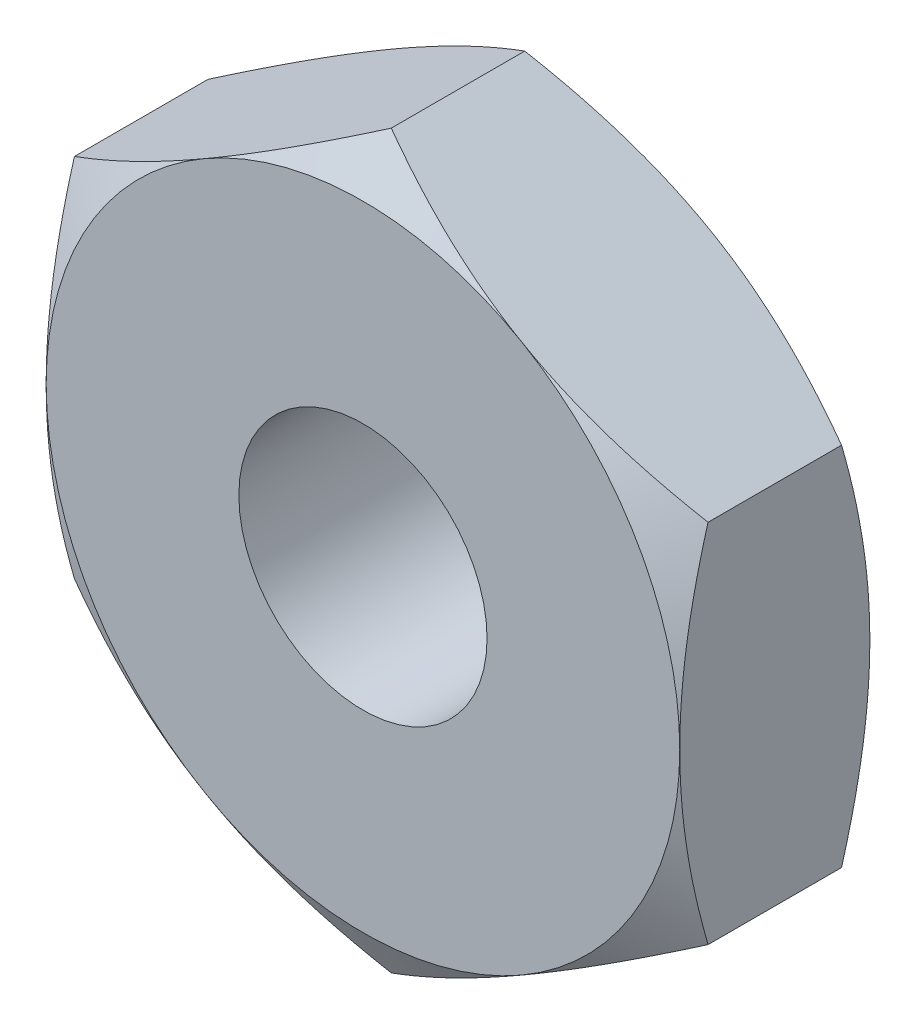
ISO-10303-21;
HEADER;
FILE_DESCRIPTION(('STEP AP214'),'2;1');
FILE_NAME('part.step','',(''),(''),'','','');
FILE_SCHEMA(('AUTOMOTIVE_DESIGN { 1 0 10303 214 1 1 1 1 }'));
ENDSEC;
DATA;
#1=APPLICATION_CONTEXT('core data for automotive mechanical design processes');
#2=APPLICATION_PROTOCOL_DEFINITION('international standard','automotive_design',2000,#1);
#3=PRODUCT_CONTEXT('',#1,'mechanical');
#4=PRODUCT('Part','Part','',(#3));
#5=PRODUCT_RELATED_PRODUCT_CATEGORY('part','',(#4));
#6=PRODUCT_DEFINITION_FORMATION('','',#4);
#7=PRODUCT_DEFINITION_CONTEXT('part definition',#1,'design');
#8=PRODUCT_DEFINITION('design','',#6,#7);
#9=PRODUCT_DEFINITION_SHAPE('','',#8);
#10=(LENGTH_UNIT() NAMED_UNIT(*) SI_UNIT(.MILLI.,.METRE.));
#11=(NAMED_UNIT(*) PLANE_ANGLE_UNIT() SI_UNIT($,.RADIAN.));
#12=(NAMED_UNIT(*) SI_UNIT($,.STERADIAN.) SOLID_ANGLE_UNIT());
#13=UNCERTAINTY_MEASURE_WITH_UNIT(LENGTH_MEASURE(1.E-05),#10,'distance_accuracy_value','');
#14=(GEOMETRIC_REPRESENTATION_CONTEXT(3) GLOBAL_UNCERTAINTY_ASSIGNED_CONTEXT((#13)) GLOBAL_UNIT_ASSIGNED_CONTEXT((#10,
#11,#12)) REPRESENTATION_CONTEXT('',''));
#15=CARTESIAN_POINT('',(0.,0.,0.));
#16=DIRECTION('',(0.,0.,1.));
#17=DIRECTION('',(1.,0.,0.));
#18=AXIS2_PLACEMENT_3D('',#15,#16,#17);
#19=CARTESIAN_POINT('',(2.,1.15470053837925,1.2));
#20=DIRECTION('',(-0.5,-0.866025403784439,0.));
#21=DIRECTION('',(0.866025403784439,-0.5,0.));
#22=AXIS2_PLACEMENT_3D('',#19,#20,#21);
#23=PLANE('',#22);
#24=CARTESIAN_POINT('',(2.0002,1.15458506832541,1.0213005333795));
#25=CARTESIAN_POINT('',(1.91230873709994,1.20532911262018,1.05061046389932));
#26=CARTESIAN_POINT('',(1.82365880552641,1.2565111744778,1.07726714801953));
#27=CARTESIAN_POINT('',(1.6448237530022,1.35976164019319,1.12379750897928));
#28=CARTESIAN_POINT('',(1.55463545349496,1.41183187919145,1.14365472361722));
#29=CARTESIAN_POINT('',(1.37537661423669,1.51532701829183,1.17456653597675));
#30=CARTESIAN_POINT('',(1.2863336617737,1.56673599086578,1.18582684840147));
#31=CARTESIAN_POINT('',(1.10782860221496,1.66979593505373,1.19927133740536));
#32=CARTESIAN_POINT('',(1.01836714429604,1.72144653186531,1.20146664504653));
#33=CARTESIAN_POINT('',(0.851191646451202,1.81796535054794,1.19690901066935));
#34=CARTESIAN_POINT('',(0.773452629734216,1.86284799277603,1.19127512531299));
#35=CARTESIAN_POINT('',(0.618481085463867,1.95232085557725,1.17341610473917));
#36=CARTESIAN_POINT('',(0.541249094258802,1.99691076648954,1.16118486397656));
#37=CARTESIAN_POINT('',(0.385957813517799,2.08656822922816,1.13060656313239));
#38=CARTESIAN_POINT('',(0.30791818689262,2.13162442866767,1.11212983293428));
#39=CARTESIAN_POINT('',(0.153003134307865,2.221064675979,1.07019448178714));
#40=CARTESIAN_POINT('',(0.07612572237688,2.26544987045196,1.04674571950769));
#41=CARTESIAN_POINT('',(-0.00019999999999991,2.30951654681234,1.0213005333795));
#42=B_SPLINE_CURVE_WITH_KNOTS('',3,(#24,#25,#26,#27,#28,#29,#30,#31,#32,#33,#34,#35,#36,#37,#38,
#39,#40,#41),.UNSPECIFIED.,.F.,.F.,(4,2,2,2,2,2,2,2,4),(0.,0.31703182469561,0.634825876346564,
0.944753967652636,1.25430138000371,1.52387047293094,1.79368946861028,2.06949491027634,
2.34475850821472),.UNSPECIFIED.);
#43=CARTESIAN_POINT('',(2.,1.15470053837925,1.02136720504592));
#44=VERTEX_POINT('',#43);
#45=CARTESIAN_POINT('',(0.999999999999999,1.73205080756888,1.2));
#46=VERTEX_POINT('',#45);
#47=EDGE_CURVE('E63',#44,#46,#42,.T.);
#48=ORIENTED_EDGE('',*,*,#47,.F.);
#49=DIRECTION('',(0.,0.,-1.));
#50=VECTOR('',#49,1.);
#51=CARTESIAN_POINT('',(2.,1.15470053837925,1.2));
#52=LINE('',#51,#50);
#53=CARTESIAN_POINT('',(2.,1.15470053837925,0.178632794954081));
#54=VERTEX_POINT('',#53);
#55=EDGE_CURVE('E302',#44,#54,#52,.T.);
#56=ORIENTED_EDGE('',*,*,#55,.T.);
#57=CARTESIAN_POINT('',(-0.0002,2.30951654681234,0.178699466620497));
#58=CARTESIAN_POINT('',(0.0876912629000598,2.25877250251758,0.149389536100678));
#59=CARTESIAN_POINT('',(0.176341194473591,2.20759044065995,0.122732851980466));
#60=CARTESIAN_POINT('',(0.355176246997802,2.10433997494456,0.0762024910207209));
#61=CARTESIAN_POINT('',(0.445364546505036,2.0522697359463,0.0563452763827792));
#62=CARTESIAN_POINT('',(0.624623385763306,1.94877459684592,0.0254334640232527));
#63=CARTESIAN_POINT('',(0.713666338226304,1.89736562427197,0.0141731515985313));
#64=CARTESIAN_POINT('',(0.892171397785043,1.79430568008402,0.000728662594642153));
#65=CARTESIAN_POINT('',(0.981632855703958,1.74265508327244,-0.00146664504653145));
#66=CARTESIAN_POINT('',(1.1488083535488,1.64613626458981,0.00309098933064917));
#67=CARTESIAN_POINT('',(1.22654737026578,1.60125362236173,0.00872487468701491));
#68=CARTESIAN_POINT('',(1.38151891453613,1.51178075956051,0.0265838952608286));
#69=CARTESIAN_POINT('',(1.4587509057412,1.46719084864821,0.0388151360234396));
#70=CARTESIAN_POINT('',(1.6140421864822,1.37753338590959,0.06939343686761));
#71=CARTESIAN_POINT('',(1.69208181310738,1.33247718647009,0.0878701670657161));
#72=CARTESIAN_POINT('',(1.84699686569214,1.24303693915875,0.129805518212856));
#73=CARTESIAN_POINT('',(1.92387427762312,1.1986517446858,0.153254280492314));
#74=CARTESIAN_POINT('',(2.0002,1.15458506832541,0.178699466620498));
#75=B_SPLINE_CURVE_WITH_KNOTS('',3,(#57,#58,#59,#60,#61,#62,#63,#64,#65,#66,#67,#68,#69,#70,#71,
#72,#73,#74),.UNSPECIFIED.,.F.,.F.,(4,2,2,2,2,2,2,2,4),(0.,0.317031824695609,0.634825876346563,
0.944753967652635,1.25430138000371,1.52387047293094,1.79368946861028,2.06949491027634,
2.34475850821472),.UNSPECIFIED.);
#76=CARTESIAN_POINT('',(1.,1.73205080756888,0.));
#77=VERTEX_POINT('',#76);
#78=EDGE_CURVE('E238',#77,#54,#75,.T.);
#79=ORIENTED_EDGE('',*,*,#78,.F.);
#80=CARTESIAN_POINT('',(0.,2.3094010767585,0.178632794954081));
#81=VERTEX_POINT('',#80);
#82=EDGE_CURVE('E256',#81,#77,#75,.T.);
#83=ORIENTED_EDGE('',*,*,#82,.F.);
#84=DIRECTION('',(0.,0.,-1.));
#85=VECTOR('',#84,1.);
#86=CARTESIAN_POINT('',(0.,2.3094010767585,1.2));
#87=LINE('',#86,#85);
#88=CARTESIAN_POINT('',(0.,2.3094010767585,1.02136720504592));
#89=VERTEX_POINT('',#88);
#90=EDGE_CURVE('E269',#89,#81,#87,.T.);
#91=ORIENTED_EDGE('',*,*,#90,.F.);
#92=EDGE_CURVE('E284',#46,#89,#42,.T.);
#93=ORIENTED_EDGE('',*,*,#92,.F.);
#94=EDGE_LOOP('',(#48,#56,#79,#83,#91,#93));
#95=FACE_BOUND('',#94,.T.);
#96=ADVANCED_FACE('F40',(#95),#23,.F.);
#97=CARTESIAN_POINT('',(0.,2.3094010767585,1.2));
#98=DIRECTION('',(0.5,-0.866025403784439,0.));
#99=DIRECTION('',(0.866025403784439,0.5,0.));
#100=AXIS2_PLACEMENT_3D('',#97,#98,#99);
#101=PLANE('',#100);
#102=CARTESIAN_POINT('',(0.000200000000000031,2.30951654681234,1.0213005333795));
#103=CARTESIAN_POINT('',(-0.0876912629000597,2.25877250251758,1.05061046389932));
#104=CARTESIAN_POINT('',(-0.176341194473591,2.20759044065995,1.07726714801953));
#105=CARTESIAN_POINT('',(-0.355176246997802,2.10433997494456,1.12379750897928));
#106=CARTESIAN_POINT('',(-0.445364546505036,2.0522697359463,1.14365472361722));
#107=CARTESIAN_POINT('',(-0.624623385763306,1.94877459684592,1.17456653597675));
#108=CARTESIAN_POINT('',(-0.713666338226304,1.89736562427197,1.18582684840147));
#109=CARTESIAN_POINT('',(-0.892171397785043,1.79430568008402,1.19927133740536));
#110=CARTESIAN_POINT('',(-0.981632855703958,1.74265508327244,1.20146664504653));
#111=CARTESIAN_POINT('',(-1.1488083535488,1.64613626458981,1.19690901066935));
#112=CARTESIAN_POINT('',(-1.22654737026578,1.60125362236173,1.19127512531299));
#113=CARTESIAN_POINT('',(-1.38151891453613,1.51178075956051,1.17341610473917));
#114=CARTESIAN_POINT('',(-1.4587509057412,1.46719084864821,1.16118486397656));
#115=CARTESIAN_POINT('',(-1.6140421864822,1.37753338590959,1.13060656313239));
#116=CARTESIAN_POINT('',(-1.69208181310738,1.33247718647009,1.11212983293428));
#117=CARTESIAN_POINT('',(-1.84699686569213,1.24303693915876,1.07019448178714));
#118=CARTESIAN_POINT('',(-1.92387427762312,1.1986517446858,1.04674571950769));
#119=CARTESIAN_POINT('',(-2.0002,1.15458506832541,1.0213005333795));
#120=B_SPLINE_CURVE_WITH_KNOTS('',3,(#102,#103,#104,#105,#106,#107,#108,#109,#110,#111,#112,
#113,#114,#115,#116,#117,#118,#119),.UNSPECIFIED.,.F.,.F.,(4,2,2,2,2,2,2,2,4),(0.,
0.31703182469561,0.634825876346563,0.944753967652635,1.25430138000371,1.52387047293094,
1.79368946861028,2.06949491027634,2.34475850821472),.UNSPECIFIED.);
#121=CARTESIAN_POINT('',(-0.999999999999999,1.73205080756888,1.2));
#122=VERTEX_POINT('',#121);
#123=EDGE_CURVE('E56',#89,#122,#120,.T.);
#124=ORIENTED_EDGE('',*,*,#123,.F.);
#125=ORIENTED_EDGE('',*,*,#90,.T.);
#126=CARTESIAN_POINT('',(-2.0002,1.15458506832541,0.178699466620498));
#127=CARTESIAN_POINT('',(-1.91230873709994,1.20532911262018,0.149389536100679));
#128=CARTESIAN_POINT('',(-1.82365880552641,1.2565111744778,0.122732851980467));
#129=CARTESIAN_POINT('',(-1.6448237530022,1.35976164019319,0.0762024910207211));
#130=CARTESIAN_POINT('',(-1.55463545349496,1.41183187919145,0.0563452763827794));
#131=CARTESIAN_POINT('',(-1.37537661423669,1.51532701829183,0.0254334640232528));
#132=CARTESIAN_POINT('',(-1.2863336617737,1.56673599086578,0.0141731515985312));
#133=CARTESIAN_POINT('',(-1.10782860221496,1.66979593505373,0.000728662594641993));
#134=CARTESIAN_POINT('',(-1.01836714429604,1.72144653186531,-0.0014666450465315));
#135=CARTESIAN_POINT('',(-0.851191646451201,1.81796535054794,0.00309098933064922));
#136=CARTESIAN_POINT('',(-0.773452629734216,1.86284799277603,0.00872487468701496));
#137=CARTESIAN_POINT('',(-0.618481085463866,1.95232085557725,0.0265838952608286));
#138=CARTESIAN_POINT('',(-0.541249094258801,1.99691076648954,0.0388151360234395));
#139=CARTESIAN_POINT('',(-0.385957813517799,2.08656822922816,0.0693934368676098));
#140=CARTESIAN_POINT('',(-0.30791818689262,2.13162442866767,0.0878701670657158));
#141=CARTESIAN_POINT('',(-0.153003134307865,2.221064675979,0.129805518212856));
#142=CARTESIAN_POINT('',(-0.0761257223768798,2.26544987045196,0.153254280492313));
#143=CARTESIAN_POINT('',(0.000199999999999939,2.30951654681234,0.178699466620497));
#144=B_SPLINE_CURVE_WITH_KNOTS('',3,(#126,#127,#128,#129,#130,#131,#132,#133,#134,#135,#136,
#137,#138,#139,#140,#141,#142,#143),.UNSPECIFIED.,.F.,.F.,(4,2,2,2,2,2,2,2,4),(0.,
0.31703182469561,0.634825876346564,0.944753967652636,1.25430138000371,1.52387047293094,
1.79368946861028,2.06949491027634,2.34475850821472),.UNSPECIFIED.);
#145=CARTESIAN_POINT('',(-0.999999999999999,1.73205080756888,0.));
#146=VERTEX_POINT('',#145);
#147=EDGE_CURVE('E200',#146,#81,#144,.T.);
#148=ORIENTED_EDGE('',*,*,#147,.F.);
#149=CARTESIAN_POINT('',(-2.,1.15470053837925,0.178632794954081));
#150=VERTEX_POINT('',#149);
#151=EDGE_CURVE('E255',#150,#146,#144,.T.);
#152=ORIENTED_EDGE('',*,*,#151,.F.);
#153=DIRECTION('',(0.,0.,-1.));
#154=VECTOR('',#153,1.);
#155=CARTESIAN_POINT('',(-2.,1.15470053837925,1.2));
#156=LINE('',#155,#154);
#157=CARTESIAN_POINT('',(-2.,1.15470053837925,1.02136720504592));
#158=VERTEX_POINT('',#157);
#159=EDGE_CURVE('E293',#158,#150,#156,.T.);
#160=ORIENTED_EDGE('',*,*,#159,.F.);
#161=EDGE_CURVE('E135',#122,#158,#120,.T.);
#162=ORIENTED_EDGE('',*,*,#161,.F.);
#163=EDGE_LOOP('',(#124,#125,#148,#152,#160,#162));
#164=FACE_BOUND('',#163,.T.);
#165=ADVANCED_FACE('F184',(#164),#101,.F.);
#166=CARTESIAN_POINT('',(-2.,1.15470053837925,1.2));
#167=DIRECTION('',(1.,0.,0.));
#168=DIRECTION('',(0.,0.,-1.));
#169=AXIS2_PLACEMENT_3D('',#166,#167,#168);
#170=PLANE('',#169);
#171=CARTESIAN_POINT('',(-2.,-3.12126753575195,0.214427111163392));
#172=CARTESIAN_POINT('',(-2.,-3.03373603218229,0.256966180284596));
#173=CARTESIAN_POINT('',(-2.,-2.94600566230316,0.29910295381188));
#174=CARTESIAN_POINT('',(-2.,-2.77004148520157,0.382345997342441));
#175=CARTESIAN_POINT('',(-2.,-2.68180760297106,0.42345210861389));
#176=CARTESIAN_POINT('',(-2.,-2.50428557268674,0.504610473872483));
#177=CARTESIAN_POINT('',(-2.,-2.41499431198977,0.544655942576512));
#178=CARTESIAN_POINT('',(-2.,-2.23570828617338,0.623133699796779));
#179=CARTESIAN_POINT('',(-2.,-2.14571355398512,0.661566063296118));
#180=CARTESIAN_POINT('',(-2.,-1.96191371862823,0.73761863742332));
#181=CARTESIAN_POINT('',(-2.,-1.86808038113767,0.775170980469068));
#182=CARTESIAN_POINT('',(-2.,-1.67934204004246,0.847473123124449));
#183=CARTESIAN_POINT('',(-2.,-1.58443713302449,0.882223173057815));
#184=CARTESIAN_POINT('',(-2.,-1.39354791487329,0.948034806351269));
#185=CARTESIAN_POINT('',(-2.,-1.29756601981645,0.979103328102883));
#186=CARTESIAN_POINT('',(-2.,-1.10422565942415,1.0365640778683));
#187=CARTESIAN_POINT('',(-2.,-1.00686763159879,1.06295775757173));
#188=CARTESIAN_POINT('',(-2.,-0.811250894561443,1.10967670182675));
#189=CARTESIAN_POINT('',(-2.,-0.713000178823259,1.13003482090968));
#190=CARTESIAN_POINT('',(-2.,-0.515257619984672,1.16354222714269));
#191=CARTESIAN_POINT('',(-2.,-0.415765905334768,1.17669225414199));
#192=CARTESIAN_POINT('',(-2.,-0.217342465065373,1.19455969688598));
#193=CARTESIAN_POINT('',(-2.,-0.118420933028611,1.19938710413721));
#194=CARTESIAN_POINT('',(-2.,0.0794683359848029,1.20050339645606));
#195=CARTESIAN_POINT('',(-2.,0.178436073915409,1.19679209666559));
#196=CARTESIAN_POINT('',(-2.,0.414659658698201,1.17806377856661));
#197=CARTESIAN_POINT('',(-2.,0.551609910334314,1.15916258692811));
#198=CARTESIAN_POINT('',(-2.,0.823054673746854,1.10826507507863));
#199=CARTESIAN_POINT('',(-2.,0.957546758578899,1.07625647399084));
#200=CARTESIAN_POINT('',(-2.,1.22689179605915,1.00181012644202));
#201=CARTESIAN_POINT('',(-2.,1.36168130453104,0.959148525574626));
#202=CARTESIAN_POINT('',(-2.,1.56197975779171,0.889897576844062));
#203=CARTESIAN_POINT('',(-2.,1.62842575478941,0.865939878069734));
#204=CARTESIAN_POINT('',(-2.,1.760766599361,0.816547213936001));
#205=CARTESIAN_POINT('',(-2.,1.82666145753252,0.791112277056875));
#206=CARTESIAN_POINT('',(-2.,1.99778681148072,0.723211373697483));
#207=CARTESIAN_POINT('',(-2.,2.10263074070295,0.679773738534194));
#208=CARTESIAN_POINT('',(-2.,2.31129679969803,0.590501658005109));
#209=CARTESIAN_POINT('',(-2.,2.41511883641139,0.544666996708215));
#210=CARTESIAN_POINT('',(-2.,2.62196120344372,0.451147524028329));
#211=CARTESIAN_POINT('',(-2.,2.72498128297199,0.403462159753722));
#212=CARTESIAN_POINT('',(-2.,2.93034706159689,0.306658203112772));
#213=CARTESIAN_POINT('',(-2.,3.03269274221776,0.257539571679235));
#214=CARTESIAN_POINT('',(-2.,3.33919760090587,0.108365604892724));
#215=CARTESIAN_POINT('',(-2.,3.54253566471784,0.00662505621000438));
#216=CARTESIAN_POINT('',(-2.,3.94769403711836,-0.199724734422693));
#217=CARTESIAN_POINT('',(-2.,4.14951461105219,-0.304333459250277));
#218=CARTESIAN_POINT('',(-2.,4.53210257052994,-0.505033547298434));
#219=CARTESIAN_POINT('',(-2.,4.71296829534757,-0.600937779133665));
#220=CARTESIAN_POINT('',(-2.,5.07407845287707,-0.793929706693538));
#221=CARTESIAN_POINT('',(-2.,5.25432285229911,-0.891017464603623));
#222=CARTESIAN_POINT('',(-2.,5.61378039587587,-1.08577789249214));
#223=CARTESIAN_POINT('',(-2.,5.79299500754525,-1.1834478572296));
#224=CARTESIAN_POINT('',(-2.,6.15103475769341,-1.37946951842422));
#225=CARTESIAN_POINT('',(-2.,6.32985992271886,-1.47782116637289));
#226=CARTESIAN_POINT('',(-2.,6.50854651271054,-1.57642218963439));
#227=B_SPLINE_CURVE_WITH_KNOTS('',3,(#171,#172,#173,#174,#175,#176,#177,#178,#179,#180,#181,
#182,#183,#184,#185,#186,#187,#188,#189,#190,#191,#192,#193,#194,#195,#196,#197,#198,#199,#200,
#201,#202,#203,#204,#205,#206,#207,#208,#209,#210,#211,#212,#213,#214,#215,#216,#217,#218,#219,
#220,#221,#222,#223,#224,#225,#226),.UNSPECIFIED.,.F.,.F.,(4,2,2,2,2,2,2,2,2,2,2,2,2,2,2,2,2,2,
2,2,2,2,2,2,2,2,2,4),(0.,0.291965851036328,0.583976394788328,0.877543441708637,1.17109682739876,
1.47426835870626,1.7774127781854,2.07997647024836,2.38244604114238,2.68323754387286,
2.98399816713488,3.28075257576361,3.57751340901528,3.99140512443003,4.40568552272406,
4.82953678217955,5.04142455234633,5.25330823879711,5.59372400123579,5.93417048231838,
6.27471946564408,6.61527774015,7.29734808498086,7.97929625318922,8.5934484852712,
9.20763312675056,9.81993507306976,10.4321938864851),.UNSPECIFIED.);
#228=CARTESIAN_POINT('',(-2.,0.,1.2));
#229=VERTEX_POINT('',#228);
#230=EDGE_CURVE('E129',#158,#229,#227,.F.);
#231=ORIENTED_EDGE('',*,*,#230,.F.);
#232=ORIENTED_EDGE('',*,*,#159,.T.);
#233=CARTESIAN_POINT('',(-2.,-3.12126753575195,0.985572888836608));
#234=CARTESIAN_POINT('',(-2.,-3.03373603218229,0.943033819715404));
#235=CARTESIAN_POINT('',(-2.,-2.94600566230316,0.90089704618812));
#236=CARTESIAN_POINT('',(-2.,-2.77004148520157,0.817654002657559));
#237=CARTESIAN_POINT('',(-2.,-2.68180760297106,0.77654789138611));
#238=CARTESIAN_POINT('',(-2.,-2.50428557268674,0.695389526127517));
#239=CARTESIAN_POINT('',(-2.,-2.41499431198977,0.655344057423488));
#240=CARTESIAN_POINT('',(-2.,-2.23570828617338,0.576866300203221));
#241=CARTESIAN_POINT('',(-2.,-2.14571355398512,0.538433936703882));
#242=CARTESIAN_POINT('',(-2.,-1.96191371862823,0.462381362576679));
#243=CARTESIAN_POINT('',(-2.,-1.86808038113767,0.424829019530932));
#244=CARTESIAN_POINT('',(-2.,-1.67934204004246,0.352526876875551));
#245=CARTESIAN_POINT('',(-2.,-1.58443713302449,0.317776826942185));
#246=CARTESIAN_POINT('',(-2.,-1.39354791487329,0.251965193648731));
#247=CARTESIAN_POINT('',(-2.,-1.29756601981645,0.220896671897117));
#248=CARTESIAN_POINT('',(-2.,-1.10422565942415,0.1634359221317));
#249=CARTESIAN_POINT('',(-2.,-1.00686763159879,0.137042242428268));
#250=CARTESIAN_POINT('',(-2.,-0.811250894561443,0.0903232981732528));
#251=CARTESIAN_POINT('',(-2.,-0.713000178823259,0.0699651790903172));
#252=CARTESIAN_POINT('',(-2.,-0.515257619984672,0.0364577728573079));
#253=CARTESIAN_POINT('',(-2.,-0.415765905334768,0.0233077458580066));
#254=CARTESIAN_POINT('',(-2.,-0.217342465065373,0.00544030311401896));
#255=CARTESIAN_POINT('',(-2.,-0.118420933028611,0.000612895862794048));
#256=CARTESIAN_POINT('',(-2.,0.0794683359848027,-0.000503396456061197));
#257=CARTESIAN_POINT('',(-2.,0.178436073915409,0.00320790333441122));
#258=CARTESIAN_POINT('',(-2.,0.414659658698201,0.0219362214333927));
#259=CARTESIAN_POINT('',(-2.,0.551609910334314,0.0408374130718859));
#260=CARTESIAN_POINT('',(-2.,0.823054673746854,0.0917349249213691));
#261=CARTESIAN_POINT('',(-2.,0.957546758578898,0.123743526009157));
#262=CARTESIAN_POINT('',(-2.,1.22689179605915,0.198189873557979));
#263=CARTESIAN_POINT('',(-2.,1.36168130453104,0.240851474425374));
#264=CARTESIAN_POINT('',(-2.,1.56197975779171,0.310102423155938));
#265=CARTESIAN_POINT('',(-2.,1.62842575478941,0.334060121930266));
#266=CARTESIAN_POINT('',(-2.,1.760766599361,0.383452786063999));
#267=CARTESIAN_POINT('',(-2.,1.82666145753252,0.408887722943125));
#268=CARTESIAN_POINT('',(-2.,1.99778681148072,0.476788626302517));
#269=CARTESIAN_POINT('',(-2.,2.10263074070295,0.520226261465806));
#270=CARTESIAN_POINT('',(-2.,2.31129679969803,0.609498341994891));
#271=CARTESIAN_POINT('',(-2.,2.41511883641139,0.655333003291785));
#272=CARTESIAN_POINT('',(-2.,2.62196120344372,0.748852475971671));
#273=CARTESIAN_POINT('',(-2.,2.72498128297198,0.796537840246278));
#274=CARTESIAN_POINT('',(-2.,2.93034706159689,0.893341796887228));
#275=CARTESIAN_POINT('',(-2.,3.03269274221776,0.942460428320764));
#276=CARTESIAN_POINT('',(-2.,3.33919760090587,1.09163439510727));
#277=CARTESIAN_POINT('',(-2.,3.54253566471784,1.19337494378999));
#278=CARTESIAN_POINT('',(-2.,3.94769403711836,1.39972473442269));
#279=CARTESIAN_POINT('',(-2.,4.14951461105219,1.50433345925028));
#280=CARTESIAN_POINT('',(-2.,4.53210257052994,1.70503354729843));
#281=CARTESIAN_POINT('',(-2.,4.71296829534757,1.80093777913366));
#282=CARTESIAN_POINT('',(-2.,5.07407845287707,1.99392970669354));
#283=CARTESIAN_POINT('',(-2.,5.2543228522991,2.09101746460362));
#284=CARTESIAN_POINT('',(-2.,5.61378039587587,2.28577789249214));
#285=CARTESIAN_POINT('',(-2.,5.79299500754525,2.3834478572296));
#286=CARTESIAN_POINT('',(-2.,6.15103475769341,2.57946951842421));
#287=CARTESIAN_POINT('',(-2.,6.32985992271886,2.67782116637289));
#288=CARTESIAN_POINT('',(-2.,6.50854651271054,2.77642218963439));
#289=B_SPLINE_CURVE_WITH_KNOTS('',3,(#233,#234,#235,#236,#237,#238,#239,#240,#241,#242,#243,
#244,#245,#246,#247,#248,#249,#250,#251,#252,#253,#254,#255,#256,#257,#258,#259,#260,#261,#262,
#263,#264,#265,#266,#267,#268,#269,#270,#271,#272,#273,#274,#275,#276,#277,#278,#279,#280,#281,
#282,#283,#284,#285,#286,#287,#288),.UNSPECIFIED.,.F.,.F.,(4,2,2,2,2,2,2,2,2,2,2,2,2,2,2,2,2,2,
2,2,2,2,2,2,2,2,2,4),(0.,0.291965851036328,0.583976394788328,0.877543441708637,1.17109682739876,
1.47426835870626,1.7774127781854,2.07997647024836,2.38244604114238,2.68323754387286,
2.98399816713488,3.28075257576361,3.57751340901528,3.99140512443003,4.40568552272406,
4.82953678217955,5.04142455234632,5.25330823879711,5.59372400123579,5.93417048231838,
6.27471946564408,6.61527774015,7.29734808498086,7.97929625318921,8.59344848527119,
9.20763312675055,9.81993507306976,10.4321938864851),.UNSPECIFIED.);
#290=CARTESIAN_POINT('',(-2.,0.,0.));
#291=VERTEX_POINT('',#290);
#292=EDGE_CURVE('E190',#291,#150,#289,.T.);
#293=ORIENTED_EDGE('',*,*,#292,.F.);
#294=CARTESIAN_POINT('',(-2.,-1.15470053837925,0.178632794954081));
#295=VERTEX_POINT('',#294);
#296=EDGE_CURVE('E198',#295,#291,#289,.T.);
#297=ORIENTED_EDGE('',*,*,#296,.F.);
#298=DIRECTION('',(0.,0.,-1.));
#299=VECTOR('',#298,1.);
#300=CARTESIAN_POINT('',(-2.,-1.15470053837925,1.2));
#301=LINE('',#300,#299);
#302=CARTESIAN_POINT('',(-2.,-1.15470053837925,1.02136720504592));
#303=VERTEX_POINT('',#302);
#304=EDGE_CURVE('E157',#303,#295,#301,.T.);
#305=ORIENTED_EDGE('',*,*,#304,.F.);
#306=EDGE_CURVE('E139',#229,#303,#227,.F.);
#307=ORIENTED_EDGE('',*,*,#306,.F.);
#308=EDGE_LOOP('',(#231,#232,#293,#297,#305,#307));
#309=FACE_BOUND('',#308,.T.);
#310=ADVANCED_FACE('F155',(#309),#170,.F.);
#311=CARTESIAN_POINT('',(-2.,-1.15470053837925,1.2));
#312=DIRECTION('',(0.5,0.866025403784439,0.));
#313=DIRECTION('',(-0.866025403784439,0.5,0.));
#314=AXIS2_PLACEMENT_3D('',#311,#312,#313);
#315=PLANE('',#314);
#316=CARTESIAN_POINT('',(-2.0002,-1.15458506832541,1.0213005333795));
#317=CARTESIAN_POINT('',(-1.91230873709994,-1.20532911262018,1.05061046389932));
#318=CARTESIAN_POINT('',(-1.82365880552641,-1.2565111744778,1.07726714801953));
#319=CARTESIAN_POINT('',(-1.6448237530022,-1.35976164019319,1.12379750897928));
#320=CARTESIAN_POINT('',(-1.55463545349496,-1.41183187919145,1.14365472361722));
#321=CARTESIAN_POINT('',(-1.37537661423669,-1.51532701829183,1.17456653597675));
#322=CARTESIAN_POINT('',(-1.2863336617737,-1.56673599086578,1.18582684840147));
#323=CARTESIAN_POINT('',(-1.10782860221496,-1.66979593505373,1.19927133740536));
#324=CARTESIAN_POINT('',(-1.01836714429604,-1.72144653186531,1.20146664504653));
#325=CARTESIAN_POINT('',(-0.851191646451202,-1.81796535054794,1.19690901066935));
#326=CARTESIAN_POINT('',(-0.773452629734216,-1.86284799277603,1.19127512531299));
#327=CARTESIAN_POINT('',(-0.618481085463867,-1.95232085557725,1.17341610473917));
#328=CARTESIAN_POINT('',(-0.541249094258802,-1.99691076648954,1.16118486397656));
#329=CARTESIAN_POINT('',(-0.385957813517799,-2.08656822922816,1.13060656313239));
#330=CARTESIAN_POINT('',(-0.307918186892621,-2.13162442866767,1.11212983293428));
#331=CARTESIAN_POINT('',(-0.153003134307866,-2.221064675979,1.07019448178714));
#332=CARTESIAN_POINT('',(-0.0761257223768802,-2.26544987045196,1.04674571950769));
#333=CARTESIAN_POINT('',(0.000199999999999905,-2.30951654681234,1.0213005333795));
#334=B_SPLINE_CURVE_WITH_KNOTS('',3,(#316,#317,#318,#319,#320,#321,#322,#323,#324,#325,#326,
#327,#328,#329,#330,#331,#332,#333),.UNSPECIFIED.,.F.,.F.,(4,2,2,2,2,2,2,2,4),(0.,
0.31703182469561,0.634825876346563,0.944753967652635,1.25430138000371,1.52387047293094,
1.79368946861028,2.06949491027634,2.34475850821472),.UNSPECIFIED.);
#335=CARTESIAN_POINT('',(-0.999999999999999,-1.73205080756888,1.2));
#336=VERTEX_POINT('',#335);
#337=EDGE_CURVE('E146',#303,#336,#334,.T.);
#338=ORIENTED_EDGE('',*,*,#337,.F.);
#339=ORIENTED_EDGE('',*,*,#304,.T.);
#340=CARTESIAN_POINT('',(0.000199999999999946,-2.30951654681234,0.178699466620497));
#341=CARTESIAN_POINT('',(-0.0876912629000602,-2.25877250251757,0.149389536100678));
#342=CARTESIAN_POINT('',(-0.176341194473592,-2.20759044065995,0.122732851980466));
#343=CARTESIAN_POINT('',(-0.355176246997802,-2.10433997494456,0.0762024910207208));
#344=CARTESIAN_POINT('',(-0.445364546505037,-2.0522697359463,0.0563452763827788));
#345=CARTESIAN_POINT('',(-0.624623385763306,-1.94877459684592,0.0254334640232524));
#346=CARTESIAN_POINT('',(-0.713666338226304,-1.89736562427197,0.0141731515985312));
#347=CARTESIAN_POINT('',(-0.892171397785043,-1.79430568008402,0.000728662594642053));
#348=CARTESIAN_POINT('',(-0.981632855703958,-1.74265508327244,-0.00146664504653164));
#349=CARTESIAN_POINT('',(-1.1488083535488,-1.64613626458981,0.00309098933064893));
#350=CARTESIAN_POINT('',(-1.22654737026578,-1.60125362236173,0.0087248746870147));
#351=CARTESIAN_POINT('',(-1.38151891453613,-1.51178075956051,0.0265838952608284));
#352=CARTESIAN_POINT('',(-1.4587509057412,-1.46719084864821,0.0388151360234394));
#353=CARTESIAN_POINT('',(-1.6140421864822,-1.37753338590959,0.0693934368676098));
#354=CARTESIAN_POINT('',(-1.69208181310738,-1.33247718647009,0.0878701670657159));
#355=CARTESIAN_POINT('',(-1.84699686569213,-1.24303693915875,0.129805518212856));
#356=CARTESIAN_POINT('',(-1.92387427762312,-1.1986517446858,0.153254280492313));
#357=CARTESIAN_POINT('',(-2.0002,-1.15458506832541,0.178699466620498));
#358=B_SPLINE_CURVE_WITH_KNOTS('',3,(#340,#341,#342,#343,#344,#345,#346,#347,#348,#349,#350,
#351,#352,#353,#354,#355,#356,#357),.UNSPECIFIED.,.F.,.F.,(4,2,2,2,2,2,2,2,4),(0.,
0.31703182469561,0.634825876346563,0.944753967652635,1.25430138000371,1.52387047293094,
1.79368946861028,2.06949491027634,2.34475850821472),.UNSPECIFIED.);
#359=CARTESIAN_POINT('',(-0.999999999999999,-1.73205080756888,0.));
#360=VERTEX_POINT('',#359);
#361=EDGE_CURVE('E199',#360,#295,#358,.T.);
#362=ORIENTED_EDGE('',*,*,#361,.F.);
#363=CARTESIAN_POINT('',(0.,-2.3094010767585,0.17863279495408));
#364=VERTEX_POINT('',#363);
#365=EDGE_CURVE('E243',#364,#360,#358,.T.);
#366=ORIENTED_EDGE('',*,*,#365,.F.);
#367=DIRECTION('',(0.,0.,-1.));
#368=VECTOR('',#367,1.);
#369=CARTESIAN_POINT('',(0.,-2.3094010767585,1.2));
#370=LINE('',#369,#368);
#371=CARTESIAN_POINT('',(0.,-2.3094010767585,1.02136720504592));
#372=VERTEX_POINT('',#371);
#373=EDGE_CURVE('E298',#372,#364,#370,.T.);
#374=ORIENTED_EDGE('',*,*,#373,.F.);
#375=EDGE_CURVE('E158',#336,#372,#334,.T.);
#376=ORIENTED_EDGE('',*,*,#375,.F.);
#377=EDGE_LOOP('',(#338,#339,#362,#366,#374,#376));
#378=FACE_BOUND('',#377,.T.);
#379=ADVANCED_FACE('F183',(#378),#315,.F.);
#380=CARTESIAN_POINT('',(0.,-2.3094010767585,1.2));
#381=DIRECTION('',(-0.5,0.866025403784439,0.));
#382=DIRECTION('',(-0.866025403784439,-0.5,0.));
#383=AXIS2_PLACEMENT_3D('',#380,#381,#382);
#384=PLANE('',#383);
#385=CARTESIAN_POINT('',(-0.000200000000000093,-2.30951654681234,1.0213005333795));
#386=CARTESIAN_POINT('',(0.0876912629000599,-2.25877250251757,1.05061046389932));
#387=CARTESIAN_POINT('',(0.176341194473591,-2.20759044065995,1.07726714801953));
#388=CARTESIAN_POINT('',(0.355176246997802,-2.10433997494456,1.12379750897928));
#389=CARTESIAN_POINT('',(0.445364546505036,-2.0522697359463,1.14365472361722));
#390=CARTESIAN_POINT('',(0.624623385763306,-1.94877459684592,1.17456653597675));
#391=CARTESIAN_POINT('',(0.713666338226304,-1.89736562427197,1.18582684840147));
#392=CARTESIAN_POINT('',(0.892171397785043,-1.79430568008402,1.19927133740536));
#393=CARTESIAN_POINT('',(0.981632855703957,-1.74265508327244,1.20146664504653));
#394=CARTESIAN_POINT('',(1.1488083535488,-1.64613626458981,1.19690901066935));
#395=CARTESIAN_POINT('',(1.22654737026578,-1.60125362236173,1.19127512531299));
#396=CARTESIAN_POINT('',(1.38151891453613,-1.51178075956051,1.17341610473917));
#397=CARTESIAN_POINT('',(1.4587509057412,-1.46719084864821,1.16118486397656));
#398=CARTESIAN_POINT('',(1.6140421864822,-1.37753338590959,1.13060656313239));
#399=CARTESIAN_POINT('',(1.69208181310738,-1.33247718647009,1.11212983293428));
#400=CARTESIAN_POINT('',(1.84699686569214,-1.24303693915875,1.07019448178714));
#401=CARTESIAN_POINT('',(1.92387427762312,-1.1986517446858,1.04674571950769));
#402=CARTESIAN_POINT('',(2.0002,-1.15458506832541,1.0213005333795));
#403=B_SPLINE_CURVE_WITH_KNOTS('',3,(#385,#386,#387,#388,#389,#390,#391,#392,#393,#394,#395,
#396,#397,#398,#399,#400,#401,#402),.UNSPECIFIED.,.F.,.F.,(4,2,2,2,2,2,2,2,4),(0.,
0.31703182469561,0.634825876346563,0.944753967652635,1.25430138000371,1.52387047293094,
1.79368946861028,2.06949491027634,2.34475850821472),.UNSPECIFIED.);
#404=CARTESIAN_POINT('',(0.999999999999999,-1.73205080756888,1.2));
#405=VERTEX_POINT('',#404);
#406=EDGE_CURVE('E418',#372,#405,#403,.T.);
#407=ORIENTED_EDGE('',*,*,#406,.F.);
#408=ORIENTED_EDGE('',*,*,#373,.T.);
#409=CARTESIAN_POINT('',(2.0002,-1.15458506832541,0.178699466620498));
#410=CARTESIAN_POINT('',(1.91230873709994,-1.20532911262018,0.149389536100679));
#411=CARTESIAN_POINT('',(1.82365880552641,-1.2565111744778,0.122732851980467));
#412=CARTESIAN_POINT('',(1.6448237530022,-1.35976164019319,0.0762024910207209));
#413=CARTESIAN_POINT('',(1.55463545349496,-1.41183187919145,0.0563452763827791));
#414=CARTESIAN_POINT('',(1.37537661423669,-1.51532701829183,0.0254334640232526));
#415=CARTESIAN_POINT('',(1.2863336617737,-1.56673599086578,0.0141731515985312));
#416=CARTESIAN_POINT('',(1.10782860221496,-1.66979593505373,0.000728662594641876));
#417=CARTESIAN_POINT('',(1.01836714429604,-1.72144653186531,-0.00146664504653191));
#418=CARTESIAN_POINT('',(0.851191646451202,-1.81796535054794,0.00309098933064858));
#419=CARTESIAN_POINT('',(0.773452629734217,-1.86284799277603,0.00872487468701433));
#420=CARTESIAN_POINT('',(0.618481085463867,-1.95232085557725,0.0265838952608282));
#421=CARTESIAN_POINT('',(0.541249094258802,-1.99691076648954,0.0388151360234393));
#422=CARTESIAN_POINT('',(0.385957813517799,-2.08656822922816,0.0693934368676097));
#423=CARTESIAN_POINT('',(0.30791818689262,-2.13162442866767,0.0878701670657156));
#424=CARTESIAN_POINT('',(0.153003134307865,-2.221064675979,0.129805518212855));
#425=CARTESIAN_POINT('',(0.0761257223768797,-2.26544987045196,0.153254280492313));
#426=CARTESIAN_POINT('',(-0.000200000000000353,-2.30951654681234,0.178699466620497));
#427=B_SPLINE_CURVE_WITH_KNOTS('',3,(#409,#410,#411,#412,#413,#414,#415,#416,#417,#418,#419,
#420,#421,#422,#423,#424,#425,#426),.UNSPECIFIED.,.F.,.F.,(4,2,2,2,2,2,2,2,4),(0.,
0.31703182469561,0.634825876346563,0.944753967652635,1.25430138000371,1.52387047293094,
1.79368946861028,2.06949491027634,2.34475850821472),.UNSPECIFIED.);
#428=CARTESIAN_POINT('',(0.999999999999999,-1.73205080756888,0.));
#429=VERTEX_POINT('',#428);
#430=EDGE_CURVE('E249',#429,#364,#427,.T.);
#431=ORIENTED_EDGE('',*,*,#430,.F.);
#432=CARTESIAN_POINT('',(2.,-1.15470053837945,0.178632794953951));
#433=VERTEX_POINT('',#432);
#434=EDGE_CURVE('E231',#433,#429,#427,.T.);
#435=ORIENTED_EDGE('',*,*,#434,.F.);
#436=DIRECTION('',(0.,0.,-1.));
#437=VECTOR('',#436,1.);
#438=CARTESIAN_POINT('',(2.,-1.15470053837925,1.2));
#439=LINE('',#438,#437);
#440=CARTESIAN_POINT('',(2.,-1.15470053837945,1.02136720504605));
#441=VERTEX_POINT('',#440);
#442=EDGE_CURVE('E300',#441,#433,#439,.T.);
#443=ORIENTED_EDGE('',*,*,#442,.F.);
#444=EDGE_CURVE('E411',#405,#441,#403,.T.);
#445=ORIENTED_EDGE('',*,*,#444,.F.);
#446=EDGE_LOOP('',(#407,#408,#431,#435,#443,#445));
#447=FACE_BOUND('',#446,.T.);
#448=ADVANCED_FACE('F319',(#447),#384,.F.);
#449=CARTESIAN_POINT('',(2.,-1.15470053837925,1.2));
#450=DIRECTION('',(-1.,0.,0.));
#451=DIRECTION('',(0.,-1.,0.));
#452=AXIS2_PLACEMENT_3D('',#449,#450,#451);
#453=PLANE('',#452);
#454=CARTESIAN_POINT('',(2.,-3.12126753575195,0.214427111163392));
#455=CARTESIAN_POINT('',(2.,-3.03373603218229,0.256966180284596));
#456=CARTESIAN_POINT('',(2.,-2.94600566230316,0.29910295381188));
#457=CARTESIAN_POINT('',(2.,-2.77004148520157,0.382345997342441));
#458=CARTESIAN_POINT('',(2.,-2.68180760297106,0.423452108613891));
#459=CARTESIAN_POINT('',(2.,-2.50428557268674,0.504610473872483));
#460=CARTESIAN_POINT('',(2.,-2.41499431198977,0.544655942576512));
#461=CARTESIAN_POINT('',(2.,-2.23570828617338,0.623133699796779));
#462=CARTESIAN_POINT('',(2.,-2.14571355398512,0.661566063296119));
#463=CARTESIAN_POINT('',(2.,-1.96191371862822,0.737618637423321));
#464=CARTESIAN_POINT('',(2.,-1.86808038113767,0.775170980469068));
#465=CARTESIAN_POINT('',(2.,-1.67934204004246,0.847473123124449));
#466=CARTESIAN_POINT('',(2.,-1.58443713302449,0.882223173057816));
#467=CARTESIAN_POINT('',(2.,-1.39354791487329,0.948034806351269));
#468=CARTESIAN_POINT('',(2.,-1.29756601981645,0.979103328102883));
#469=CARTESIAN_POINT('',(2.,-1.10422565942415,1.0365640778683));
#470=CARTESIAN_POINT('',(2.,-1.00686763159879,1.06295775757173));
#471=CARTESIAN_POINT('',(2.,-0.811250894561442,1.10967670182675));
#472=CARTESIAN_POINT('',(2.,-0.713000178823258,1.13003482090968));
#473=CARTESIAN_POINT('',(2.,-0.515257619984671,1.16354222714269));
#474=CARTESIAN_POINT('',(2.,-0.415765905334768,1.17669225414199));
#475=CARTESIAN_POINT('',(2.,-0.217342465065372,1.19455969688598));
#476=CARTESIAN_POINT('',(2.,-0.118420933028611,1.19938710413721));
#477=CARTESIAN_POINT('',(2.,0.079468335984803,1.20050339645606));
#478=CARTESIAN_POINT('',(2.,0.178436073915409,1.19679209666559));
#479=CARTESIAN_POINT('',(2.,0.414659658698201,1.17806377856661));
#480=CARTESIAN_POINT('',(2.,0.551609910334314,1.15916258692811));
#481=CARTESIAN_POINT('',(2.,0.823054673746854,1.10826507507863));
#482=CARTESIAN_POINT('',(2.,0.957546758578899,1.07625647399084));
#483=CARTESIAN_POINT('',(2.,1.22689179605915,1.00181012644202));
#484=CARTESIAN_POINT('',(2.,1.36168130453104,0.959148525574625));
#485=CARTESIAN_POINT('',(2.,1.56197975779171,0.889897576844061));
#486=CARTESIAN_POINT('',(2.,1.62842575478941,0.865939878069733));
#487=CARTESIAN_POINT('',(2.,1.760766599361,0.816547213936));
#488=CARTESIAN_POINT('',(2.,1.82666145753252,0.791112277056874));
#489=CARTESIAN_POINT('',(2.,1.99778681148072,0.723211373697483));
#490=CARTESIAN_POINT('',(2.,2.10263074070295,0.679773738534194));
#491=CARTESIAN_POINT('',(2.,2.31129679969803,0.590501658005109));
#492=CARTESIAN_POINT('',(2.,2.41511883641139,0.544666996708215));
#493=CARTESIAN_POINT('',(2.,2.62196120344372,0.451147524028329));
#494=CARTESIAN_POINT('',(2.,2.72498128297198,0.403462159753722));
#495=CARTESIAN_POINT('',(2.,2.93034706159689,0.306658203112772));
#496=CARTESIAN_POINT('',(2.,3.03269274221776,0.257539571679235));
#497=CARTESIAN_POINT('',(2.,3.33919760090587,0.108365604892724));
#498=CARTESIAN_POINT('',(2.,3.54253566471784,0.00662505621000469));
#499=CARTESIAN_POINT('',(2.,3.94769403711836,-0.199724734422692));
#500=CARTESIAN_POINT('',(2.,4.14951461105219,-0.304333459250277));
#501=CARTESIAN_POINT('',(2.,4.53210257052994,-0.505033547298433));
#502=CARTESIAN_POINT('',(2.,4.71296829534757,-0.600937779133664));
#503=CARTESIAN_POINT('',(2.,5.07407845287707,-0.793929706693537));
#504=CARTESIAN_POINT('',(2.,5.2543228522991,-0.891017464603623));
#505=CARTESIAN_POINT('',(2.,5.61378039587587,-1.08577789249214));
#506=CARTESIAN_POINT('',(2.,5.79299500754525,-1.1834478572296));
#507=CARTESIAN_POINT('',(2.,6.15103475769341,-1.37946951842422));
#508=CARTESIAN_POINT('',(2.,6.32985992271886,-1.47782116637289));
#509=CARTESIAN_POINT('',(2.,6.50854651271054,-1.57642218963439));
#510=B_SPLINE_CURVE_WITH_KNOTS('',3,(#454,#455,#456,#457,#458,#459,#460,#461,#462,#463,#464,
#465,#466,#467,#468,#469,#470,#471,#472,#473,#474,#475,#476,#477,#478,#479,#480,#481,#482,#483,
#484,#485,#486,#487,#488,#489,#490,#491,#492,#493,#494,#495,#496,#497,#498,#499,#500,#501,#502,
#503,#504,#505,#506,#507,#508,#509),.UNSPECIFIED.,.F.,.F.,(4,2,2,2,2,2,2,2,2,2,2,2,2,2,2,2,2,2,
2,2,2,2,2,2,2,2,2,4),(0.,0.291965851036328,0.583976394788328,0.877543441708637,1.17109682739876,
1.47426835870627,1.7774127781854,2.07997647024836,2.38244604114238,2.68323754387286,
2.98399816713488,3.28075257576361,3.57751340901528,3.99140512443003,4.40568552272406,
4.82953678217955,5.04142455234633,5.25330823879711,5.59372400123579,5.93417048231838,
6.27471946564408,6.61527774015,7.29734808498086,7.97929625318922,8.59344848527119,
9.20763312675056,9.81993507306976,10.4321938864851),.UNSPECIFIED.);
#511=CARTESIAN_POINT('',(2.,0.,1.2));
#512=VERTEX_POINT('',#511);
#513=EDGE_CURVE('E413',#441,#512,#510,.T.);
#514=ORIENTED_EDGE('',*,*,#513,.F.);
#515=ORIENTED_EDGE('',*,*,#442,.T.);
#516=CARTESIAN_POINT('',(2.,-3.12126753575195,0.985572888836608));
#517=CARTESIAN_POINT('',(2.,-3.03373603218229,0.943033819715404));
#518=CARTESIAN_POINT('',(2.,-2.94600566230316,0.90089704618812));
#519=CARTESIAN_POINT('',(2.,-2.77004148520157,0.817654002657558));
#520=CARTESIAN_POINT('',(2.,-2.68180760297106,0.776547891386109));
#521=CARTESIAN_POINT('',(2.,-2.50428557268674,0.695389526127516));
#522=CARTESIAN_POINT('',(2.,-2.41499431198977,0.655344057423487));
#523=CARTESIAN_POINT('',(2.,-2.23570828617338,0.57686630020322));
#524=CARTESIAN_POINT('',(2.,-2.14571355398512,0.538433936703881));
#525=CARTESIAN_POINT('',(2.,-1.96191371862822,0.462381362576679));
#526=CARTESIAN_POINT('',(2.,-1.86808038113767,0.424829019530931));
#527=CARTESIAN_POINT('',(2.,-1.67934204004246,0.35252687687555));
#528=CARTESIAN_POINT('',(2.,-1.58443713302449,0.317776826942184));
#529=CARTESIAN_POINT('',(2.,-1.39354791487329,0.251965193648731));
#530=CARTESIAN_POINT('',(2.,-1.29756601981645,0.220896671897116));
#531=CARTESIAN_POINT('',(2.,-1.10422565942415,0.1634359221317));
#532=CARTESIAN_POINT('',(2.,-1.00686763159879,0.137042242428268));
#533=CARTESIAN_POINT('',(2.,-0.811250894561442,0.0903232981732528));
#534=CARTESIAN_POINT('',(2.,-0.713000178823258,0.0699651790903175));
#535=CARTESIAN_POINT('',(2.,-0.515257619984671,0.0364577728573083));
#536=CARTESIAN_POINT('',(2.,-0.415765905334768,0.023307745858007));
#537=CARTESIAN_POINT('',(2.,-0.217342465065372,0.00544030311401928));
#538=CARTESIAN_POINT('',(2.,-0.11842093302861,0.000612895862794399));
#539=CARTESIAN_POINT('',(2.,0.0794683359848033,-0.000503396456060801));
#540=CARTESIAN_POINT('',(2.,0.17843607391541,0.00320790333441161));
#541=CARTESIAN_POINT('',(2.,0.414659658698201,0.0219362214333931));
#542=CARTESIAN_POINT('',(2.,0.551609910334315,0.0408374130718865));
#543=CARTESIAN_POINT('',(2.,0.823054673746855,0.0917349249213699));
#544=CARTESIAN_POINT('',(2.,0.9575467585789,0.123743526009158));
#545=CARTESIAN_POINT('',(2.,1.22689179605915,0.19818987355798));
#546=CARTESIAN_POINT('',(2.,1.36168130453104,0.240851474425375));
#547=CARTESIAN_POINT('',(2.,1.56197975779171,0.310102423155939));
#548=CARTESIAN_POINT('',(2.,1.62842575478941,0.334060121930267));
#549=CARTESIAN_POINT('',(2.,1.760766599361,0.383452786064));
#550=CARTESIAN_POINT('',(2.,1.82666145753252,0.408887722943126));
#551=CARTESIAN_POINT('',(2.,1.99778681148073,0.476788626302518));
#552=CARTESIAN_POINT('',(2.,2.10263074070295,0.520226261465807));
#553=CARTESIAN_POINT('',(2.,2.31129679969803,0.609498341994892));
#554=CARTESIAN_POINT('',(2.,2.41511883641139,0.655333003291786));
#555=CARTESIAN_POINT('',(2.,2.62196120344372,0.748852475971672));
#556=CARTESIAN_POINT('',(2.,2.72498128297199,0.796537840246278));
#557=CARTESIAN_POINT('',(2.,2.93034706159689,0.893341796887229));
#558=CARTESIAN_POINT('',(2.,3.03269274221776,0.942460428320765));
#559=CARTESIAN_POINT('',(2.,3.33919760090587,1.09163439510728));
#560=CARTESIAN_POINT('',(2.,3.54253566471784,1.19337494379));
#561=CARTESIAN_POINT('',(2.,3.94769403711836,1.39972473442269));
#562=CARTESIAN_POINT('',(2.,4.14951461105219,1.50433345925028));
#563=CARTESIAN_POINT('',(2.,4.53210257052994,1.70503354729843));
#564=CARTESIAN_POINT('',(2.,4.71296829534757,1.80093777913367));
#565=CARTESIAN_POINT('',(2.,5.07407845287707,1.99392970669354));
#566=CARTESIAN_POINT('',(2.,5.25432285229911,2.09101746460362));
#567=CARTESIAN_POINT('',(2.,5.61378039587587,2.28577789249214));
#568=CARTESIAN_POINT('',(2.,5.79299500754525,2.3834478572296));
#569=CARTESIAN_POINT('',(2.,6.15103475769341,2.57946951842422));
#570=CARTESIAN_POINT('',(2.,6.32985992271886,2.67782116637289));
#571=CARTESIAN_POINT('',(2.,6.50854651271054,2.77642218963439));
#572=B_SPLINE_CURVE_WITH_KNOTS('',3,(#516,#517,#518,#519,#520,#521,#522,#523,#524,#525,#526,
#527,#528,#529,#530,#531,#532,#533,#534,#535,#536,#537,#538,#539,#540,#541,#542,#543,#544,#545,
#546,#547,#548,#549,#550,#551,#552,#553,#554,#555,#556,#557,#558,#559,#560,#561,#562,#563,#564,
#565,#566,#567,#568,#569,#570,#571),.UNSPECIFIED.,.F.,.F.,(4,2,2,2,2,2,2,2,2,2,2,2,2,2,2,2,2,2,
2,2,2,2,2,2,2,2,2,4),(0.,0.291965851036329,0.583976394788329,0.877543441708638,1.17109682739876,
1.47426835870627,1.7774127781854,2.07997647024836,2.38244604114238,2.68323754387286,
2.98399816713488,3.28075257576361,3.57751340901528,3.99140512443003,4.40568552272406,
4.82953678217955,5.04142455234633,5.25330823879711,5.59372400123579,5.93417048231838,
6.27471946564408,6.61527774015,7.29734808498086,7.97929625318922,8.5934484852712,
9.20763312675056,9.81993507306976,10.4321938864851),.UNSPECIFIED.);
#573=CARTESIAN_POINT('',(2.,0.,0.));
#574=VERTEX_POINT('',#573);
#575=EDGE_CURVE('E222',#574,#433,#572,.F.);
#576=ORIENTED_EDGE('',*,*,#575,.F.);
#577=EDGE_CURVE('E151',#54,#574,#572,.F.);
#578=ORIENTED_EDGE('',*,*,#577,.F.);
#579=ORIENTED_EDGE('',*,*,#55,.F.);
#580=EDGE_CURVE('E421',#512,#44,#510,.T.);
#581=ORIENTED_EDGE('',*,*,#580,.F.);
#582=EDGE_LOOP('',(#514,#515,#576,#578,#579,#581));
#583=FACE_BOUND('',#582,.T.);
#584=ADVANCED_FACE('F313',(#583),#453,.F.);
#585=CARTESIAN_POINT('',(2.,1.15470053837925,1.2));
#586=DIRECTION('',(0.,0.,-1.));
#587=DIRECTION('',(-1.,0.,0.));
#588=AXIS2_PLACEMENT_3D('',#585,#586,#587);
#589=PLANE('',#588);
#590=CARTESIAN_POINT('',(0.,0.,1.2));
#591=DIRECTION('',(0.,0.,1.));
#592=DIRECTION('',(1.,0.,0.));
#593=AXIS2_PLACEMENT_3D('',#590,#591,#592);
#594=CIRCLE('',#593,0.7835);
#595=CARTESIAN_POINT('',(0.7835,0.,1.2));
#596=VERTEX_POINT('',#595);
#597=EDGE_CURVE('E206',#596,#596,#594,.T.);
#598=ORIENTED_EDGE('',*,*,#597,.F.);
#599=EDGE_LOOP('',(#598));
#600=FACE_BOUND('',#599,.T.);
#601=CARTESIAN_POINT('',(0.,0.,1.2));
#602=DIRECTION('',(0.,0.,-1.));
#603=DIRECTION('',(-1.,0.,0.));
#604=AXIS2_PLACEMENT_3D('',#601,#602,#603);
#605=CIRCLE('',#604,2.);
#606=EDGE_CURVE('E12',#229,#122,#605,.T.);
#607=ORIENTED_EDGE('',*,*,#606,.F.);
#608=EDGE_CURVE('E44',#336,#229,#605,.T.);
#609=ORIENTED_EDGE('',*,*,#608,.F.);
#610=EDGE_CURVE('E150',#405,#336,#605,.T.);
#611=ORIENTED_EDGE('',*,*,#610,.F.);
#612=EDGE_CURVE('E415',#512,#405,#605,.T.);
#613=ORIENTED_EDGE('',*,*,#612,.F.);
#614=CARTESIAN_POINT('',(0.,0.,1.2));
#615=DIRECTION('',(0.,0.,1.));
#616=DIRECTION('',(1.,0.,0.));
#617=AXIS2_PLACEMENT_3D('',#614,#615,#616);
#618=CIRCLE('',#617,2.);
#619=EDGE_CURVE('E514',#512,#46,#618,.T.);
#620=ORIENTED_EDGE('',*,*,#619,.T.);
#621=EDGE_CURVE('E49',#122,#46,#605,.T.);
#622=ORIENTED_EDGE('',*,*,#621,.F.);
#623=EDGE_LOOP('',(#607,#609,#611,#613,#620,#622));
#624=FACE_BOUND('',#623,.T.);
#625=ADVANCED_FACE('F152',(#600,#624),#589,.F.);
#626=CARTESIAN_POINT('',(2.,1.15470053837925,0.));
#627=DIRECTION('',(0.,0.,-1.));
#628=DIRECTION('',(-1.,0.,0.));
#629=AXIS2_PLACEMENT_3D('',#626,#627,#628);
#630=PLANE('',#629);
#631=CARTESIAN_POINT('',(0.,0.,0.));
#632=DIRECTION('',(0.,0.,1.));
#633=DIRECTION('',(1.,0.,0.));
#634=AXIS2_PLACEMENT_3D('',#631,#632,#633);
#635=CIRCLE('',#634,0.7835);
#636=CARTESIAN_POINT('',(0.7835,0.,0.));
#637=VERTEX_POINT('',#636);
#638=EDGE_CURVE('E303',#637,#637,#635,.T.);
#639=ORIENTED_EDGE('',*,*,#638,.T.);
#640=EDGE_LOOP('',(#639));
#641=FACE_BOUND('',#640,.T.);
#642=CARTESIAN_POINT('',(0.,0.,0.));
#643=DIRECTION('',(0.,0.,-1.));
#644=DIRECTION('',(-1.,0.,0.));
#645=AXIS2_PLACEMENT_3D('',#642,#643,#644);
#646=CIRCLE('',#645,2.);
#647=EDGE_CURVE('E279',#360,#291,#646,.T.);
#648=ORIENTED_EDGE('',*,*,#647,.T.);
#649=EDGE_CURVE('E265',#291,#146,#646,.T.);
#650=ORIENTED_EDGE('',*,*,#649,.T.);
#651=EDGE_CURVE('E277',#146,#77,#646,.T.);
#652=ORIENTED_EDGE('',*,*,#651,.T.);
#653=EDGE_CURVE('E281',#77,#574,#646,.T.);
#654=ORIENTED_EDGE('',*,*,#653,.T.);
#655=EDGE_CURVE('E283',#574,#429,#646,.T.);
#656=ORIENTED_EDGE('',*,*,#655,.T.);
#657=EDGE_CURVE('E282',#429,#360,#646,.T.);
#658=ORIENTED_EDGE('',*,*,#657,.T.);
#659=EDGE_LOOP('',(#648,#650,#652,#654,#656,#658));
#660=FACE_BOUND('',#659,.T.);
#661=ADVANCED_FACE('F275',(#641,#660),#630,.T.);
#662=CARTESIAN_POINT('',(0.,0.,1.2));
#663=DIRECTION('',(0.,0.,-1.));
#664=DIRECTION('',(-1.,0.,0.));
#665=AXIS2_PLACEMENT_3D('',#662,#663,#664);
#666=CYLINDRICAL_SURFACE('',#665,0.7835);
#667=ORIENTED_EDGE('',*,*,#597,.T.);
#668=EDGE_LOOP('',(#667));
#669=FACE_BOUND('',#668,.T.);
#670=ORIENTED_EDGE('',*,*,#638,.F.);
#671=EDGE_LOOP('',(#670));
#672=FACE_BOUND('',#671,.T.);
#673=ADVANCED_FACE('F216',(#669,#672),#666,.F.);
#674=CARTESIAN_POINT('',(0.,0.,0.));
#675=DIRECTION('',(0.,0.,1.));
#676=DIRECTION('',(-1.,0.,0.));
#677=AXIS2_PLACEMENT_3D('',#674,#675,#676);
#678=CONICAL_SURFACE('',#677,2.,1.0471975511966);
#679=ORIENTED_EDGE('',*,*,#434,.T.);
#680=ORIENTED_EDGE('',*,*,#655,.F.);
#681=ORIENTED_EDGE('',*,*,#575,.T.);
#682=EDGE_LOOP('',(#679,#680,#681));
#683=FACE_BOUND('',#682,.T.);
#684=ADVANCED_FACE('F215',(#683),#678,.T.);
#685=ORIENTED_EDGE('',*,*,#78,.T.);
#686=ORIENTED_EDGE('',*,*,#577,.T.);
#687=ORIENTED_EDGE('',*,*,#653,.F.);
#688=EDGE_LOOP('',(#685,#686,#687));
#689=FACE_BOUND('',#688,.T.);
#690=ADVANCED_FACE('F431',(#689),#678,.T.);
#691=ORIENTED_EDGE('',*,*,#365,.T.);
#692=ORIENTED_EDGE('',*,*,#657,.F.);
#693=ORIENTED_EDGE('',*,*,#430,.T.);
#694=EDGE_LOOP('',(#691,#692,#693));
#695=FACE_BOUND('',#694,.T.);
#696=ADVANCED_FACE('F213',(#695),#678,.T.);
#697=ORIENTED_EDGE('',*,*,#296,.T.);
#698=ORIENTED_EDGE('',*,*,#647,.F.);
#699=ORIENTED_EDGE('',*,*,#361,.T.);
#700=EDGE_LOOP('',(#697,#698,#699));
#701=FACE_BOUND('',#700,.T.);
#702=ADVANCED_FACE('F208',(#701),#678,.T.);
#703=ORIENTED_EDGE('',*,*,#292,.T.);
#704=ORIENTED_EDGE('',*,*,#151,.T.);
#705=ORIENTED_EDGE('',*,*,#649,.F.);
#706=EDGE_LOOP('',(#703,#704,#705));
#707=FACE_BOUND('',#706,.T.);
#708=ADVANCED_FACE('F212',(#707),#678,.T.);
#709=ORIENTED_EDGE('',*,*,#147,.T.);
#710=ORIENTED_EDGE('',*,*,#82,.T.);
#711=ORIENTED_EDGE('',*,*,#651,.F.);
#712=EDGE_LOOP('',(#709,#710,#711));
#713=FACE_BOUND('',#712,.T.);
#714=ADVANCED_FACE('F365',(#713),#678,.T.);
#715=CARTESIAN_POINT('',(0.,0.,1.2));
#716=DIRECTION('',(0.,0.,-1.));
#717=DIRECTION('',(1.,0.,0.));
#718=AXIS2_PLACEMENT_3D('',#715,#716,#717);
#719=CONICAL_SURFACE('',#718,2.,1.0471975511966);
#720=ORIENTED_EDGE('',*,*,#306,.T.);
#721=ORIENTED_EDGE('',*,*,#337,.T.);
#722=ORIENTED_EDGE('',*,*,#608,.T.);
#723=EDGE_LOOP('',(#720,#721,#722));
#724=FACE_BOUND('',#723,.T.);
#725=ADVANCED_FACE('F144',(#724),#719,.T.);
#726=ORIENTED_EDGE('',*,*,#375,.T.);
#727=ORIENTED_EDGE('',*,*,#406,.T.);
#728=ORIENTED_EDGE('',*,*,#610,.T.);
#729=EDGE_LOOP('',(#726,#727,#728));
#730=FACE_BOUND('',#729,.T.);
#731=ADVANCED_FACE('F364',(#730),#719,.T.);
#732=ORIENTED_EDGE('',*,*,#444,.T.);
#733=ORIENTED_EDGE('',*,*,#513,.T.);
#734=ORIENTED_EDGE('',*,*,#612,.T.);
#735=EDGE_LOOP('',(#732,#733,#734));
#736=FACE_BOUND('',#735,.T.);
#737=ADVANCED_FACE('F375',(#736),#719,.T.);
#738=ORIENTED_EDGE('',*,*,#47,.T.);
#739=ORIENTED_EDGE('',*,*,#619,.F.);
#740=ORIENTED_EDGE('',*,*,#580,.T.);
#741=EDGE_LOOP('',(#738,#739,#740));
#742=FACE_BOUND('',#741,.T.);
#743=ADVANCED_FACE('F178',(#742),#719,.T.);
#744=ORIENTED_EDGE('',*,*,#92,.T.);
#745=ORIENTED_EDGE('',*,*,#123,.T.);
#746=ORIENTED_EDGE('',*,*,#621,.T.);
#747=EDGE_LOOP('',(#744,#745,#746));
#748=FACE_BOUND('',#747,.T.);
#749=ADVANCED_FACE('F290',(#748),#719,.T.);
#750=ORIENTED_EDGE('',*,*,#161,.T.);
#751=ORIENTED_EDGE('',*,*,#230,.T.);
#752=ORIENTED_EDGE('',*,*,#606,.T.);
#753=EDGE_LOOP('',(#750,#751,#752));
#754=FACE_BOUND('',#753,.T.);
#755=ADVANCED_FACE('F131',(#754),#719,.T.);
#756=CLOSED_SHELL('',(#96,#165,#310,#379,#448,#584,#625,#661,#673,#684,#690,#696,#702,#708,#714,
#725,#731,#737,#743,#749,#755));
#757=MANIFOLD_SOLID_BREP('B2',#756);
#758=ADVANCED_BREP_SHAPE_REPRESENTATION('',(#18,#757),#14);
#759=SHAPE_DEFINITION_REPRESENTATION(#9,#758);
ENDSEC;
END-ISO-10303-21;
